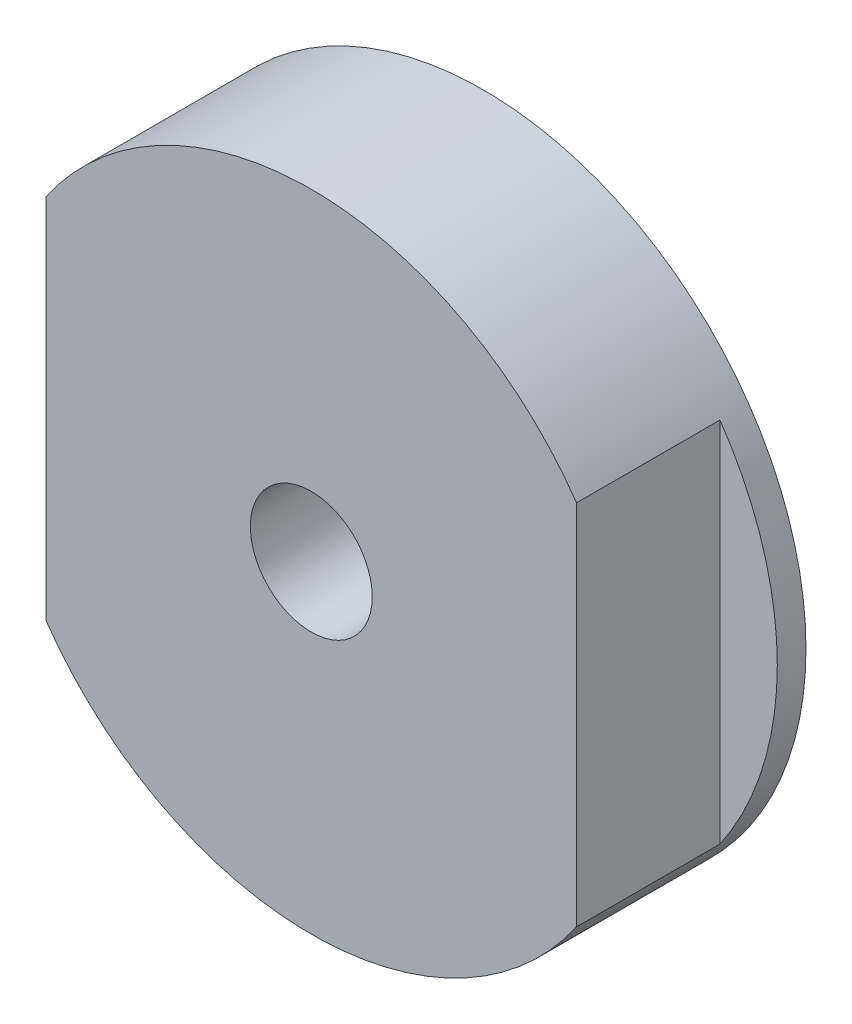
ISO-10303-21;
HEADER;
FILE_DESCRIPTION(('STEP AP214'),'2;1');
FILE_NAME('part.step','',(''),(''),'','','');
FILE_SCHEMA(('AUTOMOTIVE_DESIGN { 1 0 10303 214 1 1 1 1 }'));
ENDSEC;
DATA;
#1=APPLICATION_CONTEXT('core data for automotive mechanical design processes');
#2=APPLICATION_PROTOCOL_DEFINITION('international standard','automotive_design',2000,#1);
#3=PRODUCT_CONTEXT('',#1,'mechanical');
#4=PRODUCT('Part','Part','',(#3));
#5=PRODUCT_RELATED_PRODUCT_CATEGORY('part','',(#4));
#6=PRODUCT_DEFINITION_FORMATION('','',#4);
#7=PRODUCT_DEFINITION_CONTEXT('part definition',#1,'design');
#8=PRODUCT_DEFINITION('design','',#6,#7);
#9=PRODUCT_DEFINITION_SHAPE('','',#8);
#10=(LENGTH_UNIT() NAMED_UNIT(*) SI_UNIT(.MILLI.,.METRE.));
#11=(NAMED_UNIT(*) PLANE_ANGLE_UNIT() SI_UNIT($,.RADIAN.));
#12=(NAMED_UNIT(*) SI_UNIT($,.STERADIAN.) SOLID_ANGLE_UNIT());
#13=UNCERTAINTY_MEASURE_WITH_UNIT(LENGTH_MEASURE(1.E-05),#10,'distance_accuracy_value','');
#14=(GEOMETRIC_REPRESENTATION_CONTEXT(3) GLOBAL_UNCERTAINTY_ASSIGNED_CONTEXT((#13)) GLOBAL_UNIT_ASSIGNED_CONTEXT((#10,
#11,#12)) REPRESENTATION_CONTEXT('',''));
#15=CARTESIAN_POINT('',(0.,0.,0.));
#16=DIRECTION('',(0.,0.,1.));
#17=DIRECTION('',(1.,0.,0.));
#18=AXIS2_PLACEMENT_3D('',#15,#16,#17);
#19=CARTESIAN_POINT('',(0.,0.,12.));
#20=DIRECTION('',(0.,0.,-1.));
#21=DIRECTION('',(-1.,0.,0.));
#22=AXIS2_PLACEMENT_3D('',#19,#20,#21);
#23=CYLINDRICAL_SURFACE('',#22,22.5);
#24=CARTESIAN_POINT('',(0.,0.,12.));
#25=DIRECTION('',(0.,0.,1.));
#26=DIRECTION('',(1.,0.,0.));
#27=AXIS2_PLACEMENT_3D('',#24,#25,#26);
#28=CIRCLE('',#27,22.5);
#29=CARTESIAN_POINT('',(-18.5,-12.8062484748657,12.));
#30=VERTEX_POINT('',#29);
#31=CARTESIAN_POINT('',(18.5,-12.8062484748657,12.));
#32=VERTEX_POINT('',#31);
#33=EDGE_CURVE('E56',#30,#32,#28,.T.);
#34=ORIENTED_EDGE('',*,*,#33,.F.);
#35=DIRECTION('',(0.,0.,1.));
#36=VECTOR('',#35,1.);
#37=CARTESIAN_POINT('',(-18.5,-12.8062484748657,2.));
#38=LINE('',#37,#36);
#39=CARTESIAN_POINT('',(-18.5,-12.8062484748657,2.));
#40=VERTEX_POINT('',#39);
#41=EDGE_CURVE('E63',#40,#30,#38,.T.);
#42=ORIENTED_EDGE('',*,*,#41,.F.);
#43=CARTESIAN_POINT('',(0.,0.,2.));
#44=DIRECTION('',(0.,0.,1.));
#45=DIRECTION('',(1.,0.,0.));
#46=AXIS2_PLACEMENT_3D('',#43,#44,#45);
#47=CIRCLE('',#46,22.5);
#48=CARTESIAN_POINT('',(-18.5,12.8062484748657,2.));
#49=VERTEX_POINT('',#48);
#50=EDGE_CURVE('E151',#49,#40,#47,.T.);
#51=ORIENTED_EDGE('',*,*,#50,.F.);
#52=DIRECTION('',(0.,0.,1.));
#53=VECTOR('',#52,1.);
#54=CARTESIAN_POINT('',(-18.5,12.8062484748657,2.));
#55=LINE('',#54,#53);
#56=CARTESIAN_POINT('',(-18.5,12.8062484748657,12.));
#57=VERTEX_POINT('',#56);
#58=EDGE_CURVE('E162',#49,#57,#55,.T.);
#59=ORIENTED_EDGE('',*,*,#58,.T.);
#60=CARTESIAN_POINT('',(18.5,12.8062484748657,12.));
#61=VERTEX_POINT('',#60);
#62=EDGE_CURVE('E11',#61,#57,#28,.T.);
#63=ORIENTED_EDGE('',*,*,#62,.F.);
#64=DIRECTION('',(0.,0.,1.));
#65=VECTOR('',#64,1.);
#66=CARTESIAN_POINT('',(18.5,12.8062484748657,2.));
#67=LINE('',#66,#65);
#68=CARTESIAN_POINT('',(18.5,12.8062484748657,2.));
#69=VERTEX_POINT('',#68);
#70=EDGE_CURVE('E71',#69,#61,#67,.T.);
#71=ORIENTED_EDGE('',*,*,#70,.F.);
#72=CARTESIAN_POINT('',(0.,0.,2.));
#73=DIRECTION('',(0.,0.,1.));
#74=DIRECTION('',(1.,0.,0.));
#75=AXIS2_PLACEMENT_3D('',#72,#73,#74);
#76=CIRCLE('',#75,22.5);
#77=CARTESIAN_POINT('',(18.5,-12.8062484748657,2.));
#78=VERTEX_POINT('',#77);
#79=EDGE_CURVE('E176',#78,#69,#76,.T.);
#80=ORIENTED_EDGE('',*,*,#79,.F.);
#81=DIRECTION('',(0.,0.,1.));
#82=VECTOR('',#81,1.);
#83=CARTESIAN_POINT('',(18.5,-12.8062484748657,2.));
#84=LINE('',#83,#82);
#85=EDGE_CURVE('E150',#78,#32,#84,.T.);
#86=ORIENTED_EDGE('',*,*,#85,.T.);
#87=EDGE_LOOP('',(#34,#42,#51,#59,#63,#71,#80,#86));
#88=FACE_BOUND('',#87,.T.);
#89=CARTESIAN_POINT('',(0.,0.,0.));
#90=DIRECTION('',(0.,0.,1.));
#91=DIRECTION('',(1.,0.,0.));
#92=AXIS2_PLACEMENT_3D('',#89,#90,#91);
#93=CIRCLE('',#92,22.5);
#94=CARTESIAN_POINT('',(22.5,0.,0.));
#95=VERTEX_POINT('',#94);
#96=EDGE_CURVE('E50',#95,#95,#93,.T.);
#97=ORIENTED_EDGE('',*,*,#96,.T.);
#98=EDGE_LOOP('',(#97));
#99=FACE_BOUND('',#98,.T.);
#100=ADVANCED_FACE('F47',(#88,#99),#23,.T.);
#101=CARTESIAN_POINT('',(0.,0.,12.));
#102=DIRECTION('',(0.,0.,1.));
#103=DIRECTION('',(1.,0.,0.));
#104=AXIS2_PLACEMENT_3D('',#101,#102,#103);
#105=PLANE('',#104);
#106=CARTESIAN_POINT('',(0.,0.,12.));
#107=DIRECTION('',(0.,0.,1.));
#108=DIRECTION('',(1.,0.,0.));
#109=AXIS2_PLACEMENT_3D('',#106,#107,#108);
#110=CIRCLE('',#109,4.25);
#111=CARTESIAN_POINT('',(4.25,0.,12.));
#112=VERTEX_POINT('',#111);
#113=EDGE_CURVE('E142',#112,#112,#110,.T.);
#114=ORIENTED_EDGE('',*,*,#113,.F.);
#115=EDGE_LOOP('',(#114));
#116=FACE_BOUND('',#115,.T.);
#117=DIRECTION('',(0.,1.,0.));
#118=VECTOR('',#117,1.);
#119=CARTESIAN_POINT('',(-18.5,12.8062484748657,12.));
#120=LINE('',#119,#118);
#121=EDGE_CURVE('E155',#30,#57,#120,.T.);
#122=ORIENTED_EDGE('',*,*,#121,.F.);
#123=ORIENTED_EDGE('',*,*,#33,.T.);
#124=DIRECTION('',(0.,-1.,0.));
#125=VECTOR('',#124,1.);
#126=CARTESIAN_POINT('',(18.5,12.8062484748657,12.));
#127=LINE('',#126,#125);
#128=EDGE_CURVE('E161',#61,#32,#127,.T.);
#129=ORIENTED_EDGE('',*,*,#128,.F.);
#130=ORIENTED_EDGE('',*,*,#62,.T.);
#131=EDGE_LOOP('',(#122,#123,#129,#130));
#132=FACE_BOUND('',#131,.T.);
#133=ADVANCED_FACE('F191',(#116,#132),#105,.T.);
#134=CARTESIAN_POINT('',(0.,0.,0.));
#135=DIRECTION('',(0.,0.,1.));
#136=DIRECTION('',(1.,0.,0.));
#137=AXIS2_PLACEMENT_3D('',#134,#135,#136);
#138=PLANE('',#137);
#139=CARTESIAN_POINT('',(12.0208152801711,12.0208152801715,0.));
#140=DIRECTION('',(0.,0.,-1.));
#141=DIRECTION('',(-1.,0.,0.));
#142=AXIS2_PLACEMENT_3D('',#139,#140,#141);
#143=CIRCLE('',#142,1.64999999999999);
#144=CARTESIAN_POINT('',(10.3708152801711,12.0208152801715,0.));
#145=VERTEX_POINT('',#144);
#146=EDGE_CURVE('E113',#145,#145,#143,.T.);
#147=ORIENTED_EDGE('',*,*,#146,.F.);
#148=EDGE_LOOP('',(#147));
#149=FACE_BOUND('',#148,.T.);
#150=CARTESIAN_POINT('',(12.0208152801714,-12.0208152801712,0.));
#151=DIRECTION('',(0.,0.,-1.));
#152=DIRECTION('',(-1.,0.,0.));
#153=AXIS2_PLACEMENT_3D('',#150,#151,#152);
#154=CIRCLE('',#153,1.64999999999999);
#155=CARTESIAN_POINT('',(10.3708152801714,-12.0208152801712,0.));
#156=VERTEX_POINT('',#155);
#157=EDGE_CURVE('E112',#156,#156,#154,.T.);
#158=ORIENTED_EDGE('',*,*,#157,.F.);
#159=EDGE_LOOP('',(#158));
#160=FACE_BOUND('',#159,.T.);
#161=CARTESIAN_POINT('',(-12.0208152801712,-12.0208152801714,0.));
#162=DIRECTION('',(0.,0.,-1.));
#163=DIRECTION('',(-1.,0.,0.));
#164=AXIS2_PLACEMENT_3D('',#161,#162,#163);
#165=CIRCLE('',#164,1.64999999999999);
#166=CARTESIAN_POINT('',(-13.6708152801712,-12.0208152801714,0.));
#167=VERTEX_POINT('',#166);
#168=EDGE_CURVE('E126',#167,#167,#165,.T.);
#169=ORIENTED_EDGE('',*,*,#168,.F.);
#170=EDGE_LOOP('',(#169));
#171=FACE_BOUND('',#170,.T.);
#172=CARTESIAN_POINT('',(-12.0208152801714,12.0208152801712,0.));
#173=DIRECTION('',(0.,0.,-1.));
#174=DIRECTION('',(-1.,0.,0.));
#175=AXIS2_PLACEMENT_3D('',#172,#173,#174);
#176=CIRCLE('',#175,1.64999999999999);
#177=CARTESIAN_POINT('',(-13.6708152801714,12.0208152801712,0.));
#178=VERTEX_POINT('',#177);
#179=EDGE_CURVE('E134',#178,#178,#176,.T.);
#180=ORIENTED_EDGE('',*,*,#179,.F.);
#181=EDGE_LOOP('',(#180));
#182=FACE_BOUND('',#181,.T.);
#183=CARTESIAN_POINT('',(0.,0.,0.));
#184=DIRECTION('',(0.,0.,1.));
#185=DIRECTION('',(1.,0.,0.));
#186=AXIS2_PLACEMENT_3D('',#183,#184,#185);
#187=CIRCLE('',#186,4.25);
#188=CARTESIAN_POINT('',(4.25,0.,0.));
#189=VERTEX_POINT('',#188);
#190=EDGE_CURVE('E146',#189,#189,#187,.T.);
#191=ORIENTED_EDGE('',*,*,#190,.T.);
#192=EDGE_LOOP('',(#191));
#193=FACE_BOUND('',#192,.T.);
#194=ORIENTED_EDGE('',*,*,#96,.F.);
#195=EDGE_LOOP('',(#194));
#196=FACE_BOUND('',#195,.T.);
#197=ADVANCED_FACE('F198',(#149,#160,#171,#182,#193,#196),#138,.F.);
#198=CARTESIAN_POINT('',(18.5,12.8062484748657,2.));
#199=DIRECTION('',(-1.,0.,0.));
#200=DIRECTION('',(0.,0.,1.));
#201=AXIS2_PLACEMENT_3D('',#198,#199,#200);
#202=PLANE('',#201);
#203=ORIENTED_EDGE('',*,*,#128,.T.);
#204=ORIENTED_EDGE('',*,*,#85,.F.);
#205=DIRECTION('',(0.,-1.,0.));
#206=VECTOR('',#205,1.);
#207=CARTESIAN_POINT('',(18.5,12.8062484748657,2.));
#208=LINE('',#207,#206);
#209=EDGE_CURVE('E170',#69,#78,#208,.T.);
#210=ORIENTED_EDGE('',*,*,#209,.F.);
#211=ORIENTED_EDGE('',*,*,#70,.T.);
#212=EDGE_LOOP('',(#203,#204,#210,#211));
#213=FACE_BOUND('',#212,.T.);
#214=ADVANCED_FACE('F185',(#213),#202,.F.);
#215=CARTESIAN_POINT('',(0.,0.,2.));
#216=DIRECTION('',(0.,0.,1.));
#217=DIRECTION('',(1.,0.,0.));
#218=AXIS2_PLACEMENT_3D('',#215,#216,#217);
#219=PLANE('',#218);
#220=ORIENTED_EDGE('',*,*,#79,.T.);
#221=ORIENTED_EDGE('',*,*,#209,.T.);
#222=EDGE_LOOP('',(#220,#221));
#223=FACE_BOUND('',#222,.T.);
#224=ADVANCED_FACE('F183',(#223),#219,.T.);
#225=CARTESIAN_POINT('',(-18.5,12.8062484748657,2.));
#226=DIRECTION('',(1.,0.,0.));
#227=DIRECTION('',(0.,0.,-1.));
#228=AXIS2_PLACEMENT_3D('',#225,#226,#227);
#229=PLANE('',#228);
#230=ORIENTED_EDGE('',*,*,#121,.T.);
#231=ORIENTED_EDGE('',*,*,#58,.F.);
#232=DIRECTION('',(0.,1.,0.));
#233=VECTOR('',#232,1.);
#234=CARTESIAN_POINT('',(-18.5,12.8062484748657,2.));
#235=LINE('',#234,#233);
#236=EDGE_CURVE('E154',#40,#49,#235,.T.);
#237=ORIENTED_EDGE('',*,*,#236,.F.);
#238=ORIENTED_EDGE('',*,*,#41,.T.);
#239=EDGE_LOOP('',(#230,#231,#237,#238));
#240=FACE_BOUND('',#239,.T.);
#241=ADVANCED_FACE('F356',(#240),#229,.F.);
#242=CARTESIAN_POINT('',(0.,0.,2.));
#243=DIRECTION('',(0.,0.,1.));
#244=DIRECTION('',(1.,0.,0.));
#245=AXIS2_PLACEMENT_3D('',#242,#243,#244);
#246=PLANE('',#245);
#247=ORIENTED_EDGE('',*,*,#50,.T.);
#248=ORIENTED_EDGE('',*,*,#236,.T.);
#249=EDGE_LOOP('',(#247,#248));
#250=FACE_BOUND('',#249,.T.);
#251=ADVANCED_FACE('F226',(#250),#246,.T.);
#252=CARTESIAN_POINT('',(0.,0.,12.));
#253=DIRECTION('',(0.,0.,1.));
#254=DIRECTION('',(1.,0.,0.));
#255=AXIS2_PLACEMENT_3D('',#252,#253,#254);
#256=CYLINDRICAL_SURFACE('',#255,4.25);
#257=ORIENTED_EDGE('',*,*,#113,.T.);
#258=EDGE_LOOP('',(#257));
#259=FACE_BOUND('',#258,.T.);
#260=ORIENTED_EDGE('',*,*,#190,.F.);
#261=EDGE_LOOP('',(#260));
#262=FACE_BOUND('',#261,.T.);
#263=ADVANCED_FACE('F231',(#259,#262),#256,.F.);
#264=CARTESIAN_POINT('',(-12.0208152801714,12.0208152801712,10.1));
#265=DIRECTION('',(0.,0.,-1.));
#266=DIRECTION('',(-1.,0.,0.));
#267=AXIS2_PLACEMENT_3D('',#264,#265,#266);
#268=CONICAL_SURFACE('',#267,1.64999999999999,1.02974425867665);
#269=CARTESIAN_POINT('',(-12.0208152801714,12.0208152801712,11.0914200213955));
#270=VERTEX_POINT('',#269);
#271=VERTEX_LOOP('',#270);
#272=FACE_BOUND('',#271,.T.);
#273=CARTESIAN_POINT('',(-12.0208152801714,12.0208152801712,10.1));
#274=DIRECTION('',(0.,0.,-1.));
#275=DIRECTION('',(-1.,0.,0.));
#276=AXIS2_PLACEMENT_3D('',#273,#274,#275);
#277=CIRCLE('',#276,1.64999999999999);
#278=CARTESIAN_POINT('',(-13.6708152801714,12.0208152801712,10.1));
#279=VERTEX_POINT('',#278);
#280=EDGE_CURVE('E138',#279,#279,#277,.T.);
#281=ORIENTED_EDGE('',*,*,#280,.T.);
#282=EDGE_LOOP('',(#281));
#283=FACE_BOUND('',#282,.T.);
#284=ADVANCED_FACE('F237',(#272,#283),#268,.F.);
#285=CARTESIAN_POINT('',(-12.0208152801714,12.0208152801712,0.));
#286=DIRECTION('',(0.,0.,-1.));
#287=DIRECTION('',(-1.,0.,0.));
#288=AXIS2_PLACEMENT_3D('',#285,#286,#287);
#289=CYLINDRICAL_SURFACE('',#288,1.64999999999999);
#290=ORIENTED_EDGE('',*,*,#280,.F.);
#291=EDGE_LOOP('',(#290));
#292=FACE_BOUND('',#291,.T.);
#293=ORIENTED_EDGE('',*,*,#179,.T.);
#294=EDGE_LOOP('',(#293));
#295=FACE_BOUND('',#294,.T.);
#296=ADVANCED_FACE('F249',(#292,#295),#289,.F.);
#297=CARTESIAN_POINT('',(-12.0208152801712,-12.0208152801714,10.1));
#298=DIRECTION('',(0.,0.,-1.));
#299=DIRECTION('',(-1.,0.,0.));
#300=AXIS2_PLACEMENT_3D('',#297,#298,#299);
#301=CONICAL_SURFACE('',#300,1.64999999999999,1.02974425867665);
#302=CARTESIAN_POINT('',(-12.0208152801712,-12.0208152801714,11.0914200213955));
#303=VERTEX_POINT('',#302);
#304=VERTEX_LOOP('',#303);
#305=FACE_BOUND('',#304,.T.);
#306=CARTESIAN_POINT('',(-12.0208152801712,-12.0208152801714,10.1));
#307=DIRECTION('',(0.,0.,-1.));
#308=DIRECTION('',(-1.,0.,0.));
#309=AXIS2_PLACEMENT_3D('',#306,#307,#308);
#310=CIRCLE('',#309,1.64999999999999);
#311=CARTESIAN_POINT('',(-13.6708152801712,-12.0208152801714,10.1));
#312=VERTEX_POINT('',#311);
#313=EDGE_CURVE('E130',#312,#312,#310,.T.);
#314=ORIENTED_EDGE('',*,*,#313,.T.);
#315=EDGE_LOOP('',(#314));
#316=FACE_BOUND('',#315,.T.);
#317=ADVANCED_FACE('F259',(#305,#316),#301,.F.);
#318=CARTESIAN_POINT('',(-12.0208152801712,-12.0208152801714,0.));
#319=DIRECTION('',(0.,0.,-1.));
#320=DIRECTION('',(-1.,0.,0.));
#321=AXIS2_PLACEMENT_3D('',#318,#319,#320);
#322=CYLINDRICAL_SURFACE('',#321,1.64999999999999);
#323=ORIENTED_EDGE('',*,*,#313,.F.);
#324=EDGE_LOOP('',(#323));
#325=FACE_BOUND('',#324,.T.);
#326=ORIENTED_EDGE('',*,*,#168,.T.);
#327=EDGE_LOOP('',(#326));
#328=FACE_BOUND('',#327,.T.);
#329=ADVANCED_FACE('F278',(#325,#328),#322,.F.);
#330=CARTESIAN_POINT('',(12.0208152801714,-12.0208152801712,10.1));
#331=DIRECTION('',(0.,0.,-1.));
#332=DIRECTION('',(-1.,0.,0.));
#333=AXIS2_PLACEMENT_3D('',#330,#331,#332);
#334=CONICAL_SURFACE('',#333,1.64999999999999,1.02974425867665);
#335=CARTESIAN_POINT('',(12.0208152801714,-12.0208152801712,11.0914200213955));
#336=VERTEX_POINT('',#335);
#337=VERTEX_LOOP('',#336);
#338=FACE_BOUND('',#337,.T.);
#339=CARTESIAN_POINT('',(12.0208152801714,-12.0208152801712,10.1));
#340=DIRECTION('',(0.,0.,-1.));
#341=DIRECTION('',(-1.,0.,0.));
#342=AXIS2_PLACEMENT_3D('',#339,#340,#341);
#343=CIRCLE('',#342,1.64999999999999);
#344=CARTESIAN_POINT('',(10.3708152801714,-12.0208152801712,10.1));
#345=VERTEX_POINT('',#344);
#346=EDGE_CURVE('E118',#345,#345,#343,.T.);
#347=ORIENTED_EDGE('',*,*,#346,.T.);
#348=EDGE_LOOP('',(#347));
#349=FACE_BOUND('',#348,.T.);
#350=ADVANCED_FACE('F290',(#338,#349),#334,.F.);
#351=CARTESIAN_POINT('',(12.0208152801714,-12.0208152801712,0.));
#352=DIRECTION('',(0.,0.,-1.));
#353=DIRECTION('',(-1.,0.,0.));
#354=AXIS2_PLACEMENT_3D('',#351,#352,#353);
#355=CYLINDRICAL_SURFACE('',#354,1.64999999999999);
#356=ORIENTED_EDGE('',*,*,#346,.F.);
#357=EDGE_LOOP('',(#356));
#358=FACE_BOUND('',#357,.T.);
#359=ORIENTED_EDGE('',*,*,#157,.T.);
#360=EDGE_LOOP('',(#359));
#361=FACE_BOUND('',#360,.T.);
#362=ADVANCED_FACE('F105',(#358,#361),#355,.F.);
#363=CARTESIAN_POINT('',(12.0208152801711,12.0208152801715,10.1));
#364=DIRECTION('',(0.,0.,-1.));
#365=DIRECTION('',(-1.,0.,0.));
#366=AXIS2_PLACEMENT_3D('',#363,#364,#365);
#367=CONICAL_SURFACE('',#366,1.64999999999999,1.02974425867665);
#368=CARTESIAN_POINT('',(12.0208152801711,12.0208152801715,11.0914200213955));
#369=VERTEX_POINT('',#368);
#370=VERTEX_LOOP('',#369);
#371=FACE_BOUND('',#370,.T.);
#372=CARTESIAN_POINT('',(12.0208152801711,12.0208152801715,10.1));
#373=DIRECTION('',(0.,0.,-1.));
#374=DIRECTION('',(-1.,0.,0.));
#375=AXIS2_PLACEMENT_3D('',#372,#373,#374);
#376=CIRCLE('',#375,1.64999999999999);
#377=CARTESIAN_POINT('',(10.3708152801711,12.0208152801715,10.1));
#378=VERTEX_POINT('',#377);
#379=EDGE_CURVE('E109',#378,#378,#376,.T.);
#380=ORIENTED_EDGE('',*,*,#379,.T.);
#381=EDGE_LOOP('',(#380));
#382=FACE_BOUND('',#381,.T.);
#383=ADVANCED_FACE('F101',(#371,#382),#367,.F.);
#384=CARTESIAN_POINT('',(12.0208152801711,12.0208152801715,0.));
#385=DIRECTION('',(0.,0.,-1.));
#386=DIRECTION('',(-1.,0.,0.));
#387=AXIS2_PLACEMENT_3D('',#384,#385,#386);
#388=CYLINDRICAL_SURFACE('',#387,1.64999999999999);
#389=ORIENTED_EDGE('',*,*,#379,.F.);
#390=EDGE_LOOP('',(#389));
#391=FACE_BOUND('',#390,.T.);
#392=ORIENTED_EDGE('',*,*,#146,.T.);
#393=EDGE_LOOP('',(#392));
#394=FACE_BOUND('',#393,.T.);
#395=ADVANCED_FACE('F104',(#391,#394),#388,.F.);
#396=CLOSED_SHELL('',(#100,#133,#197,#214,#224,#241,#251,#263,#284,#296,#317,#329,#350,#362,
#383,#395));
#397=MANIFOLD_SOLID_BREP('B2',#396);
#398=ADVANCED_BREP_SHAPE_REPRESENTATION('',(#18,#397),#14);
#399=SHAPE_DEFINITION_REPRESENTATION(#9,#398);
ENDSEC;
END-ISO-10303-21;
